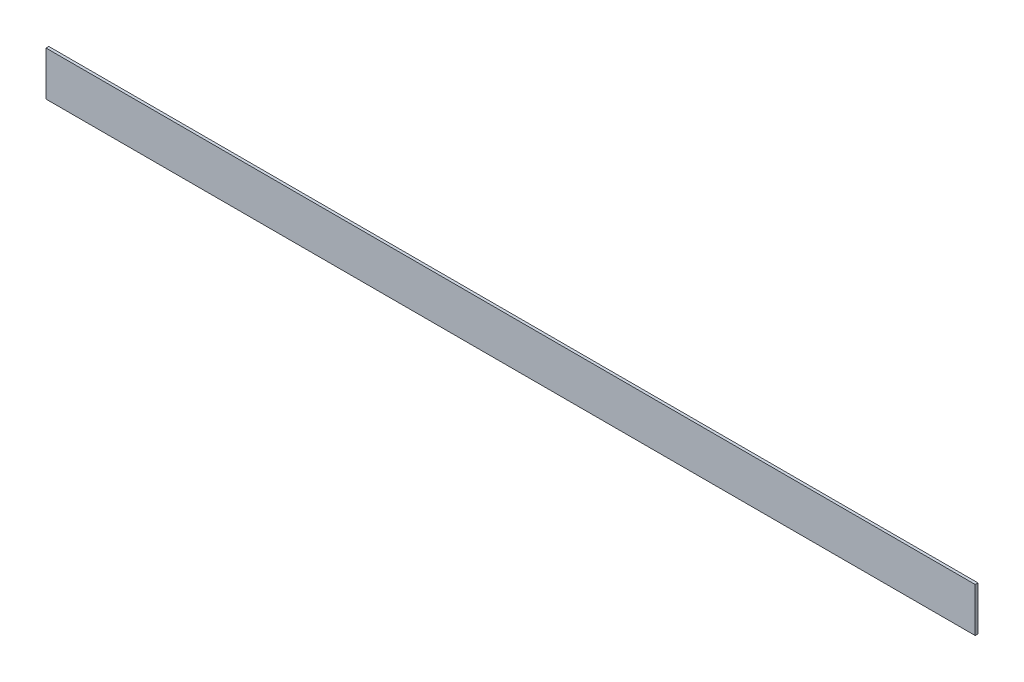
ISO-10303-21;
HEADER;
FILE_DESCRIPTION(('STEP AP214'),'2;1');
FILE_NAME('part.step','',(''),(''),'','','');
FILE_SCHEMA(('AUTOMOTIVE_DESIGN { 1 0 10303 214 1 1 1 1 }'));
ENDSEC;
DATA;
#1=APPLICATION_CONTEXT('core data for automotive mechanical design processes');
#2=APPLICATION_PROTOCOL_DEFINITION('international standard','automotive_design',2000,#1);
#3=PRODUCT_CONTEXT('',#1,'mechanical');
#4=PRODUCT('Part','Part','',(#3));
#5=PRODUCT_RELATED_PRODUCT_CATEGORY('part','',(#4));
#6=PRODUCT_DEFINITION_FORMATION('','',#4);
#7=PRODUCT_DEFINITION_CONTEXT('part definition',#1,'design');
#8=PRODUCT_DEFINITION('design','',#6,#7);
#9=PRODUCT_DEFINITION_SHAPE('','',#8);
#10=(LENGTH_UNIT() NAMED_UNIT(*) SI_UNIT(.MILLI.,.METRE.));
#11=(NAMED_UNIT(*) PLANE_ANGLE_UNIT() SI_UNIT($,.RADIAN.));
#12=(NAMED_UNIT(*) SI_UNIT($,.STERADIAN.) SOLID_ANGLE_UNIT());
#13=UNCERTAINTY_MEASURE_WITH_UNIT(LENGTH_MEASURE(1.E-05),#10,'distance_accuracy_value','');
#14=(GEOMETRIC_REPRESENTATION_CONTEXT(3) GLOBAL_UNCERTAINTY_ASSIGNED_CONTEXT((#13)) GLOBAL_UNIT_ASSIGNED_CONTEXT((#10,
#11,#12)) REPRESENTATION_CONTEXT('',''));
#15=CARTESIAN_POINT('',(0.,0.,0.));
#16=DIRECTION('',(0.,0.,1.));
#17=DIRECTION('',(1.,0.,0.));
#18=AXIS2_PLACEMENT_3D('',#15,#16,#17);
#19=CARTESIAN_POINT('',(0.,0.,3.175));
#20=DIRECTION('',(-1.,0.,0.));
#21=DIRECTION('',(0.,0.,1.));
#22=AXIS2_PLACEMENT_3D('',#19,#20,#21);
#23=PLANE('',#22);
#24=DIRECTION('',(0.,1.,0.));
#25=VECTOR('',#24,1.);
#26=CARTESIAN_POINT('',(0.,0.,0.));
#27=LINE('',#26,#25);
#28=CARTESIAN_POINT('',(0.,-50.8,0.));
#29=VERTEX_POINT('',#28);
#30=CARTESIAN_POINT('',(0.,0.,0.));
#31=VERTEX_POINT('',#30);
#32=EDGE_CURVE('E98',#29,#31,#27,.T.);
#33=ORIENTED_EDGE('',*,*,#32,.T.);
#34=DIRECTION('',(0.,0.,-1.));
#35=VECTOR('',#34,1.);
#36=CARTESIAN_POINT('',(0.,0.,3.175));
#37=LINE('',#36,#35);
#38=CARTESIAN_POINT('',(0.,0.,3.175));
#39=VERTEX_POINT('',#38);
#40=EDGE_CURVE('E11',#39,#31,#37,.T.);
#41=ORIENTED_EDGE('',*,*,#40,.F.);
#42=DIRECTION('',(0.,1.,0.));
#43=VECTOR('',#42,1.);
#44=CARTESIAN_POINT('',(0.,0.,3.175));
#45=LINE('',#44,#43);
#46=CARTESIAN_POINT('',(0.,-50.8,3.175));
#47=VERTEX_POINT('',#46);
#48=EDGE_CURVE('E86',#47,#39,#45,.T.);
#49=ORIENTED_EDGE('',*,*,#48,.F.);
#50=DIRECTION('',(0.,0.,-1.));
#51=VECTOR('',#50,1.);
#52=CARTESIAN_POINT('',(0.,-50.8,3.175));
#53=LINE('',#52,#51);
#54=EDGE_CURVE('E94',#47,#29,#53,.T.);
#55=ORIENTED_EDGE('',*,*,#54,.T.);
#56=EDGE_LOOP('',(#33,#41,#49,#55));
#57=FACE_BOUND('',#56,.T.);
#58=ADVANCED_FACE('F35',(#57),#23,.F.);
#59=CARTESIAN_POINT('',(0.,0.,3.175));
#60=DIRECTION('',(0.,-1.,0.));
#61=DIRECTION('',(1.,0.,0.));
#62=AXIS2_PLACEMENT_3D('',#59,#60,#61);
#63=PLANE('',#62);
#64=DIRECTION('',(-1.,0.,0.));
#65=VECTOR('',#64,1.);
#66=CARTESIAN_POINT('',(0.,0.,0.));
#67=LINE('',#66,#65);
#68=CARTESIAN_POINT('',(-1066.8,-1.3064532053304E-13,0.));
#69=VERTEX_POINT('',#68);
#70=EDGE_CURVE('E90',#31,#69,#67,.T.);
#71=ORIENTED_EDGE('',*,*,#70,.T.);
#72=DIRECTION('',(0.,0.,-1.));
#73=VECTOR('',#72,1.);
#74=CARTESIAN_POINT('',(-1066.8,-1.3064532053304E-13,3.175));
#75=LINE('',#74,#73);
#76=CARTESIAN_POINT('',(-1066.8,-1.3064532053304E-13,3.175));
#77=VERTEX_POINT('',#76);
#78=EDGE_CURVE('E43',#77,#69,#75,.T.);
#79=ORIENTED_EDGE('',*,*,#78,.F.);
#80=DIRECTION('',(-1.,0.,0.));
#81=VECTOR('',#80,1.);
#82=CARTESIAN_POINT('',(0.,0.,3.175));
#83=LINE('',#82,#81);
#84=EDGE_CURVE('E81',#39,#77,#83,.T.);
#85=ORIENTED_EDGE('',*,*,#84,.F.);
#86=ORIENTED_EDGE('',*,*,#40,.T.);
#87=EDGE_LOOP('',(#71,#79,#85,#86));
#88=FACE_BOUND('',#87,.T.);
#89=ADVANCED_FACE('F89',(#88),#63,.F.);
#90=CARTESIAN_POINT('',(-1066.8,-1.3064532053304E-13,3.175));
#91=DIRECTION('',(1.,0.,0.));
#92=DIRECTION('',(0.,0.,-1.));
#93=AXIS2_PLACEMENT_3D('',#90,#91,#92);
#94=PLANE('',#93);
#95=DIRECTION('',(0.,-1.,0.));
#96=VECTOR('',#95,1.);
#97=CARTESIAN_POINT('',(-1066.8,-1.3064532053304E-13,0.));
#98=LINE('',#97,#96);
#99=CARTESIAN_POINT('',(-1066.8,-50.8000000000001,0.));
#100=VERTEX_POINT('',#99);
#101=EDGE_CURVE('E68',#69,#100,#98,.T.);
#102=ORIENTED_EDGE('',*,*,#101,.T.);
#103=DIRECTION('',(0.,0.,-1.));
#104=VECTOR('',#103,1.);
#105=CARTESIAN_POINT('',(-1066.8,-50.8000000000001,3.175));
#106=LINE('',#105,#104);
#107=CARTESIAN_POINT('',(-1066.8,-50.8000000000001,3.175));
#108=VERTEX_POINT('',#107);
#109=EDGE_CURVE('E91',#108,#100,#106,.T.);
#110=ORIENTED_EDGE('',*,*,#109,.F.);
#111=DIRECTION('',(0.,-1.,0.));
#112=VECTOR('',#111,1.);
#113=CARTESIAN_POINT('',(-1066.8,-1.3064532053304E-13,3.175));
#114=LINE('',#113,#112);
#115=EDGE_CURVE('E84',#77,#108,#114,.T.);
#116=ORIENTED_EDGE('',*,*,#115,.F.);
#117=ORIENTED_EDGE('',*,*,#78,.T.);
#118=EDGE_LOOP('',(#102,#110,#116,#117));
#119=FACE_BOUND('',#118,.T.);
#120=ADVANCED_FACE('F92',(#119),#94,.F.);
#121=CARTESIAN_POINT('',(0.,-50.8,3.175));
#122=DIRECTION('',(0.,1.,0.));
#123=DIRECTION('',(-1.,0.,0.));
#124=AXIS2_PLACEMENT_3D('',#121,#122,#123);
#125=PLANE('',#124);
#126=DIRECTION('',(1.,0.,0.));
#127=VECTOR('',#126,1.);
#128=CARTESIAN_POINT('',(0.,-50.8,0.));
#129=LINE('',#128,#127);
#130=EDGE_CURVE('E74',#100,#29,#129,.T.);
#131=ORIENTED_EDGE('',*,*,#130,.T.);
#132=ORIENTED_EDGE('',*,*,#54,.F.);
#133=DIRECTION('',(1.,0.,0.));
#134=VECTOR('',#133,1.);
#135=CARTESIAN_POINT('',(0.,-50.8,3.175));
#136=LINE('',#135,#134);
#137=EDGE_CURVE('E51',#108,#47,#136,.T.);
#138=ORIENTED_EDGE('',*,*,#137,.F.);
#139=ORIENTED_EDGE('',*,*,#109,.T.);
#140=EDGE_LOOP('',(#131,#132,#138,#139));
#141=FACE_BOUND('',#140,.T.);
#142=ADVANCED_FACE('F105',(#141),#125,.F.);
#143=CARTESIAN_POINT('',(0.,0.,3.175));
#144=DIRECTION('',(0.,0.,-1.));
#145=DIRECTION('',(-1.,0.,0.));
#146=AXIS2_PLACEMENT_3D('',#143,#144,#145);
#147=PLANE('',#146);
#148=ORIENTED_EDGE('',*,*,#48,.T.);
#149=ORIENTED_EDGE('',*,*,#84,.T.);
#150=ORIENTED_EDGE('',*,*,#115,.T.);
#151=ORIENTED_EDGE('',*,*,#137,.T.);
#152=EDGE_LOOP('',(#148,#149,#150,#151));
#153=FACE_BOUND('',#152,.T.);
#154=ADVANCED_FACE('F82',(#153),#147,.F.);
#155=CARTESIAN_POINT('',(0.,0.,0.));
#156=DIRECTION('',(0.,0.,-1.));
#157=DIRECTION('',(-1.,0.,0.));
#158=AXIS2_PLACEMENT_3D('',#155,#156,#157);
#159=PLANE('',#158);
#160=ORIENTED_EDGE('',*,*,#32,.F.);
#161=ORIENTED_EDGE('',*,*,#130,.F.);
#162=ORIENTED_EDGE('',*,*,#101,.F.);
#163=ORIENTED_EDGE('',*,*,#70,.F.);
#164=EDGE_LOOP('',(#160,#161,#162,#163));
#165=FACE_BOUND('',#164,.T.);
#166=ADVANCED_FACE('F108',(#165),#159,.T.);
#167=CLOSED_SHELL('',(#58,#89,#120,#142,#154,#166));
#168=MANIFOLD_SOLID_BREP('B2',#167);
#169=ADVANCED_BREP_SHAPE_REPRESENTATION('',(#18,#168),#14);
#170=SHAPE_DEFINITION_REPRESENTATION(#9,#169);
ENDSEC;
END-ISO-10303-21;
